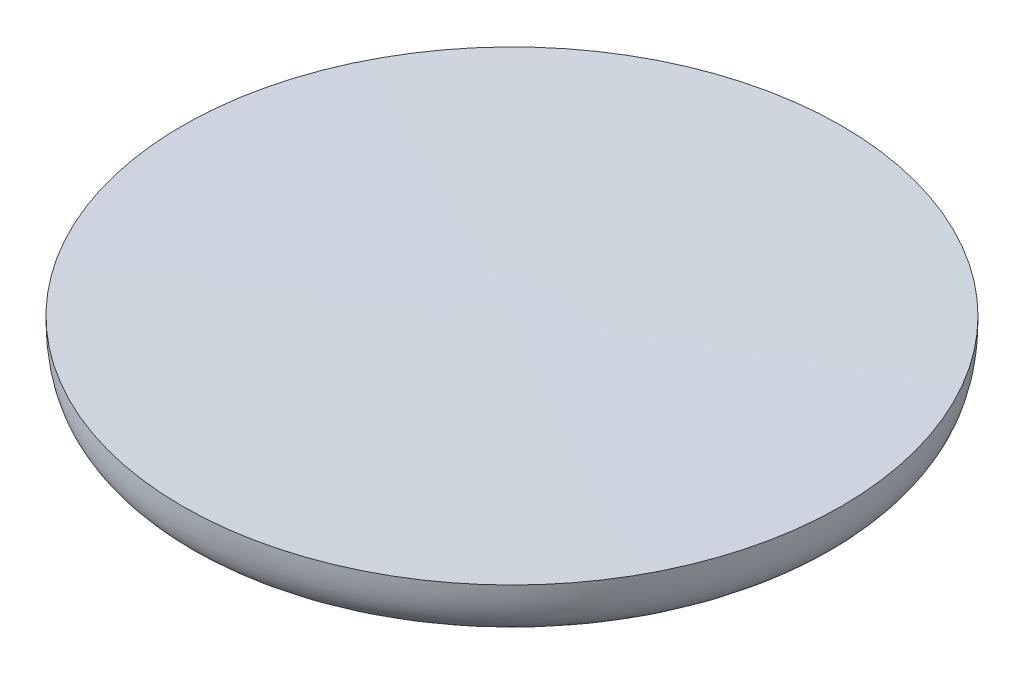
ISO-10303-21;
HEADER;
FILE_DESCRIPTION(('STEP AP214'),'2;1');
FILE_NAME('part.step','',(''),(''),'','','');
FILE_SCHEMA(('AUTOMOTIVE_DESIGN { 1 0 10303 214 1 1 1 1 }'));
ENDSEC;
DATA;
#1=APPLICATION_CONTEXT('core data for automotive mechanical design processes');
#2=APPLICATION_PROTOCOL_DEFINITION('international standard','automotive_design',2000,#1);
#3=PRODUCT_CONTEXT('',#1,'mechanical');
#4=PRODUCT('Part','Part','',(#3));
#5=PRODUCT_RELATED_PRODUCT_CATEGORY('part','',(#4));
#6=PRODUCT_DEFINITION_FORMATION('','',#4);
#7=PRODUCT_DEFINITION_CONTEXT('part definition',#1,'design');
#8=PRODUCT_DEFINITION('design','',#6,#7);
#9=PRODUCT_DEFINITION_SHAPE('','',#8);
#10=(LENGTH_UNIT() NAMED_UNIT(*) SI_UNIT(.MILLI.,.METRE.));
#11=(NAMED_UNIT(*) PLANE_ANGLE_UNIT() SI_UNIT($,.RADIAN.));
#12=(NAMED_UNIT(*) SI_UNIT($,.STERADIAN.) SOLID_ANGLE_UNIT());
#13=UNCERTAINTY_MEASURE_WITH_UNIT(LENGTH_MEASURE(1.E-05),#10,'distance_accuracy_value','');
#14=(GEOMETRIC_REPRESENTATION_CONTEXT(3) GLOBAL_UNCERTAINTY_ASSIGNED_CONTEXT((#13)) GLOBAL_UNIT_ASSIGNED_CONTEXT((#10,
#11,#12)) REPRESENTATION_CONTEXT('',''));
#15=CARTESIAN_POINT('',(0.,0.,0.));
#16=DIRECTION('',(0.,0.,1.));
#17=DIRECTION('',(1.,0.,0.));
#18=AXIS2_PLACEMENT_3D('',#15,#16,#17);
#19=CARTESIAN_POINT('',(0.,0.,0.));
#20=CARTESIAN_POINT('',(48.0418319143582,0.879529239897307,0.));
#21=CARTESIAN_POINT('',(65.2973736827645,-0.330016453125546,0.));
#22=CARTESIAN_POINT('',(120.038778041739,3.9588575237254,0.));
#23=CARTESIAN_POINT('',(124.,14.6373467810012,0.));
#24=CARTESIAN_POINT('',(124.,25.,0.));
#25=B_SPLINE_CURVE_WITH_KNOTS('',3,(#19,#20,#21,#22,#23,#24),.UNSPECIFIED.,.F.,.F.,(4,1,1,4),
(0.,0.691991516018299,0.860699736627175,1.),.UNSPECIFIED.);
#26=CARTESIAN_POINT('',(0.,0.,0.));
#27=DIRECTION('',(0.,-1.,0.));
#28=AXIS1_PLACEMENT('',#26,#27);
#29=SURFACE_OF_REVOLUTION('',#25,#28);
#30=CARTESIAN_POINT('',(0.,25.,0.));
#31=DIRECTION('',(0.,-1.,0.));
#32=DIRECTION('',(0.,0.,-1.));
#33=AXIS2_PLACEMENT_3D('',#30,#31,#32);
#34=CIRCLE('',#33,124.);
#35=CARTESIAN_POINT('',(0.,25.,-124.));
#36=VERTEX_POINT('',#35);
#37=EDGE_CURVE('E11',#36,#36,#34,.T.);
#38=ORIENTED_EDGE('',*,*,#37,.T.);
#39=EDGE_LOOP('',(#38));
#40=FACE_BOUND('',#39,.T.);
#41=CARTESIAN_POINT('',(0.,0.,0.));
#42=VERTEX_POINT('',#41);
#43=VERTEX_LOOP('',#42);
#44=FACE_BOUND('',#43,.T.);
#45=ADVANCED_FACE('F33',(#40,#44),#29,.F.);
#46=CARTESIAN_POINT('',(0.,25.,0.));
#47=DIRECTION('',(0.,1.,0.));
#48=DIRECTION('',(0.,0.,1.));
#49=AXIS2_PLACEMENT_3D('',#46,#47,#48);
#50=CONICAL_SURFACE('',#49,124.,1.56320043148839);
#51=CARTESIAN_POINT('',(0.,24.0580908666164,0.));
#52=VERTEX_POINT('',#51);
#53=VERTEX_LOOP('',#52);
#54=FACE_BOUND('',#53,.T.);
#55=ORIENTED_EDGE('',*,*,#37,.F.);
#56=EDGE_LOOP('',(#55));
#57=FACE_BOUND('',#56,.T.);
#58=ADVANCED_FACE('F45',(#54,#57),#50,.F.);
#59=CLOSED_SHELL('',(#45,#58));
#60=MANIFOLD_SOLID_BREP('B2',#59);
#61=ADVANCED_BREP_SHAPE_REPRESENTATION('',(#18,#60),#14);
#62=SHAPE_DEFINITION_REPRESENTATION(#9,#61);
ENDSEC;
END-ISO-10303-21;
